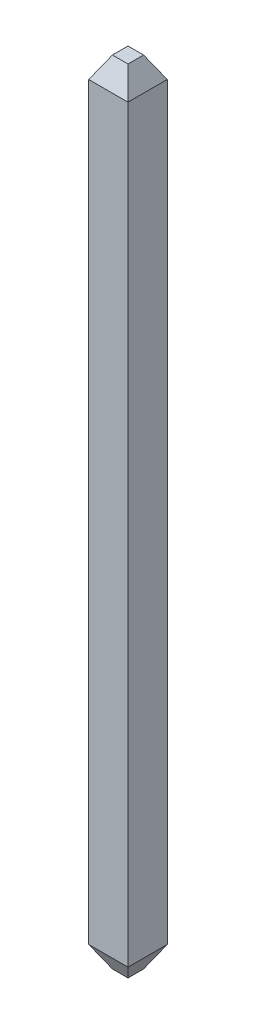
ISO-10303-21;
HEADER;
FILE_DESCRIPTION(('STEP AP214'),'2;1');
FILE_NAME('part.step','',(''),(''),'','','');
FILE_SCHEMA(('AUTOMOTIVE_DESIGN { 1 0 10303 214 1 1 1 1 }'));
ENDSEC;
DATA;
#1=APPLICATION_CONTEXT('core data for automotive mechanical design processes');
#2=APPLICATION_PROTOCOL_DEFINITION('international standard','automotive_design',2000,#1);
#3=PRODUCT_CONTEXT('',#1,'mechanical');
#4=PRODUCT('Part','Part','',(#3));
#5=PRODUCT_RELATED_PRODUCT_CATEGORY('part','',(#4));
#6=PRODUCT_DEFINITION_FORMATION('','',#4);
#7=PRODUCT_DEFINITION_CONTEXT('part definition',#1,'design');
#8=PRODUCT_DEFINITION('design','',#6,#7);
#9=PRODUCT_DEFINITION_SHAPE('','',#8);
#10=(LENGTH_UNIT() NAMED_UNIT(*) SI_UNIT(.MILLI.,.METRE.));
#11=(NAMED_UNIT(*) PLANE_ANGLE_UNIT() SI_UNIT($,.RADIAN.));
#12=(NAMED_UNIT(*) SI_UNIT($,.STERADIAN.) SOLID_ANGLE_UNIT());
#13=UNCERTAINTY_MEASURE_WITH_UNIT(LENGTH_MEASURE(1.E-05),#10,'distance_accuracy_value','');
#14=(GEOMETRIC_REPRESENTATION_CONTEXT(3) GLOBAL_UNCERTAINTY_ASSIGNED_CONTEXT((#13)) GLOBAL_UNIT_ASSIGNED_CONTEXT((#10,
#11,#12)) REPRESENTATION_CONTEXT('',''));
#15=CARTESIAN_POINT('',(0.,0.,0.));
#16=DIRECTION('',(0.,0.,1.));
#17=DIRECTION('',(1.,0.,0.));
#18=AXIS2_PLACEMENT_3D('',#15,#16,#17);
#19=CARTESIAN_POINT('',(0.497289871213,-21.22226807941,7.329039407632));
#20=DIRECTION('',(0.,0.488489958076213,0.87256951634738));
#21=DIRECTION('',(0.,-0.87256951634738,0.488489958076213));
#22=AXIS2_PLACEMENT_3D('',#19,#20,#21);
#23=PLANE('',#22);
#24=DIRECTION('',(1.,0.,0.));
#25=VECTOR('',#24,1.);
#26=CARTESIAN_POINT('',(0.497289871213,-21.57099360271,7.52426616385793));
#27=LINE('',#26,#25);
#28=CARTESIAN_POINT('',(0.48728989589798,-21.5709939289416,7.52426616384538));
#29=VERTEX_POINT('',#28);
#30=CARTESIAN_POINT('',(-0.142710289145667,-21.5709938896675,7.52426632450452));
#31=VERTEX_POINT('',#30);
#32=EDGE_CURVE('E118',#29,#31,#27,.F.);
#33=ORIENTED_EDGE('',*,*,#32,.F.);
#34=DIRECTION('',(0.438284036988266,-0.784297353956642,0.439072617567844));
#35=VECTOR('',#34,1.);
#36=CARTESIAN_POINT('',(0.29728987121219,-21.2309937745705,7.333924307213));
#37=LINE('',#36,#35);
#38=CARTESIAN_POINT('',(0.297289871212797,-21.2309937745703,7.33392430721258));
#39=VERTEX_POINT('',#38);
#40=EDGE_CURVE('E116',#39,#29,#37,.T.);
#41=ORIENTED_EDGE('',*,*,#40,.F.);
#42=DIRECTION('',(-1.,0.,0.));
#43=VECTOR('',#42,1.);
#44=CARTESIAN_POINT('',(0.307289871213,-21.23099377457,7.333924307213));
#45=LINE('',#44,#43);
#46=CARTESIAN_POINT('',(0.0472898712130297,-21.2309937745702,7.33392430721258));
#47=VERTEX_POINT('',#46);
#48=EDGE_CURVE('E79',#47,#39,#45,.F.);
#49=ORIENTED_EDGE('',*,*,#48,.F.);
#50=DIRECTION('',(0.438284036988272,0.784297353956654,-0.439072617567815));
#51=VECTOR('',#50,1.);
#52=CARTESIAN_POINT('',(-0.14271012878781,-21.5709936027095,7.524266163858));
#53=LINE('',#52,#51);
#54=EDGE_CURVE('E110',#31,#47,#53,.T.);
#55=ORIENTED_EDGE('',*,*,#54,.F.);
#56=EDGE_LOOP('',(#33,#41,#49,#55));
#57=FACE_BOUND('',#56,.T.);
#58=ADVANCED_FACE('F17',(#57),#23,.T.);
#59=CARTESIAN_POINT('',(0.497289871213,-33.93541112064,7.329291335356));
#60=DIRECTION('',(0.,-0.487152273933216,0.873317045523387));
#61=DIRECTION('',(0.,-0.873317045523387,-0.487152273933216));
#62=AXIS2_PLACEMENT_3D('',#59,#60,#61);
#63=PLANE('',#62);
#64=DIRECTION('',(-0.438586917260297,-0.784839349958942,-0.437799852403053));
#65=VECTOR('',#64,1.);
#66=CARTESIAN_POINT('',(0.487290184384019,-33.5866775616409,7.523822206765));
#67=LINE('',#66,#65);
#68=CARTESIAN_POINT('',(0.487289980136551,-33.5866774630266,7.52382196176172));
#69=VERTEX_POINT('',#68);
#70=CARTESIAN_POINT('',(0.29728987121302,-33.9266779501895,7.33416285809401));
#71=VERTEX_POINT('',#70);
#72=EDGE_CURVE('E122',#69,#71,#67,.T.);
#73=ORIENTED_EDGE('',*,*,#72,.F.);
#74=DIRECTION('',(1.,0.,0.));
#75=VECTOR('',#74,1.);
#76=CARTESIAN_POINT('',(0.497289871213,-33.5866774970136,7.52382284621967));
#77=LINE('',#76,#75);
#78=CARTESIAN_POINT('',(-0.142710305819022,-33.5866774872793,7.52382196001637));
#79=VERTEX_POINT('',#78);
#80=EDGE_CURVE('E89',#79,#69,#77,.T.);
#81=ORIENTED_EDGE('',*,*,#80,.F.);
#82=DIRECTION('',(-0.438586917260197,0.78483934995876,0.437799852403479));
#83=VECTOR('',#82,1.);
#84=CARTESIAN_POINT('',(0.0472898712136261,-33.9266779501897,7.334162858095));
#85=LINE('',#84,#83);
#86=CARTESIAN_POINT('',(0.0472898712132013,-33.9266779501894,7.33416285809401));
#87=VERTEX_POINT('',#86);
#88=EDGE_CURVE('E84',#87,#79,#85,.T.);
#89=ORIENTED_EDGE('',*,*,#88,.F.);
#90=DIRECTION('',(1.,0.,0.));
#91=VECTOR('',#90,1.);
#92=CARTESIAN_POINT('',(0.03728987121306,-33.92667795019,7.334162858095));
#93=LINE('',#92,#91);
#94=EDGE_CURVE('E20',#71,#87,#93,.F.);
#95=ORIENTED_EDGE('',*,*,#94,.F.);
#96=EDGE_LOOP('',(#73,#81,#89,#95));
#97=FACE_BOUND('',#96,.T.);
#98=ADVANCED_FACE('F86',(#97),#63,.T.);
#99=CARTESIAN_POINT('',(0.03728987121306,-33.92667795019,7.074162858095));
#100=DIRECTION('',(0.,-1.,0.));
#101=DIRECTION('',(1.,0.,0.));
#102=AXIS2_PLACEMENT_3D('',#99,#100,#101);
#103=PLANE('',#102);
#104=DIRECTION('',(0.,0.,1.));
#105=VECTOR('',#104,1.);
#106=CARTESIAN_POINT('',(0.0472898712136262,-33.9266779501897,6.883821001451));
#107=LINE('',#106,#105);
#108=CARTESIAN_POINT('',(0.0472898712133431,-33.9266779501896,7.08416285809541));
#109=VERTEX_POINT('',#108);
#110=EDGE_CURVE('E93',#109,#87,#107,.T.);
#111=ORIENTED_EDGE('',*,*,#110,.F.);
#112=DIRECTION('',(1.,0.,0.));
#113=VECTOR('',#112,1.);
#114=CARTESIAN_POINT('',(0.497289871213,-33.9266779501891,7.08416285809666));
#115=LINE('',#114,#113);
#116=CARTESIAN_POINT('',(0.29728987121304,-33.9266779501898,7.08416285809541));
#117=VERTEX_POINT('',#116);
#118=EDGE_CURVE('E129',#117,#109,#115,.F.);
#119=ORIENTED_EDGE('',*,*,#118,.F.);
#120=DIRECTION('',(0.,0.,1.));
#121=VECTOR('',#120,1.);
#122=CARTESIAN_POINT('',(0.297289871213079,-33.92667795019,6.883821001451));
#123=LINE('',#122,#121);
#124=EDGE_CURVE('E98',#71,#117,#123,.F.);
#125=ORIENTED_EDGE('',*,*,#124,.F.);
#126=ORIENTED_EDGE('',*,*,#94,.T.);
#127=EDGE_LOOP('',(#111,#119,#125,#126));
#128=FACE_BOUND('',#127,.T.);
#129=ADVANCED_FACE('F95',(#128),#103,.T.);
#130=CARTESIAN_POINT('',(0.05216808666874,-33.93540738396,6.883821001451));
#131=DIRECTION('',(-0.872943377132686,-0.487821545567825,0.));
#132=DIRECTION('',(0.487821545567825,-0.872943377132686,0.));
#133=AXIS2_PLACEMENT_3D('',#130,#131,#132);
#134=PLANE('',#133);
#135=DIRECTION('',(-0.43828470044216,0.784297071672232,-0.43907245953793));
#136=VECTOR('',#135,1.);
#137=CARTESIAN_POINT('',(0.04728987121306,-33.9266779501891,7.08416285809666));
#138=LINE('',#137,#136);
#139=CARTESIAN_POINT('',(-0.142710211258918,-33.5866782459584,6.89382181091626));
#140=VERTEX_POINT('',#139);
#141=EDGE_CURVE('E102',#109,#140,#138,.T.);
#142=ORIENTED_EDGE('',*,*,#141,.F.);
#143=ORIENTED_EDGE('',*,*,#110,.T.);
#144=ORIENTED_EDGE('',*,*,#88,.T.);
#145=DIRECTION('',(0.,0.,1.));
#146=VECTOR('',#145,1.);
#147=CARTESIAN_POINT('',(-0.142710128787,-33.58667874778,7.208990896586));
#148=LINE('',#147,#146);
#149=EDGE_CURVE('E131',#140,#79,#148,.T.);
#150=ORIENTED_EDGE('',*,*,#149,.F.);
#151=EDGE_LOOP('',(#142,#143,#144,#150));
#152=FACE_BOUND('',#151,.T.);
#153=ADVANCED_FACE('F100',(#152),#134,.T.);
#154=CARTESIAN_POINT('',(0.307289871213,-21.23099377457,7.073924307213));
#155=DIRECTION('',(0.,1.,0.));
#156=DIRECTION('',(-1.,0.,0.));
#157=AXIS2_PLACEMENT_3D('',#154,#155,#156);
#158=PLANE('',#157);
#159=ORIENTED_EDGE('',*,*,#48,.T.);
#160=DIRECTION('',(0.,0.,1.));
#161=VECTOR('',#160,1.);
#162=CARTESIAN_POINT('',(0.29728987121219,-21.2309937745705,6.884266163858));
#163=LINE('',#162,#161);
#164=CARTESIAN_POINT('',(0.297289871212797,-21.2309937745704,7.08392430721349));
#165=VERTEX_POINT('',#164);
#166=EDGE_CURVE('E113',#165,#39,#163,.T.);
#167=ORIENTED_EDGE('',*,*,#166,.F.);
#168=DIRECTION('',(1.,0.,0.));
#169=VECTOR('',#168,1.);
#170=CARTESIAN_POINT('',(0.497289871213,-21.2309937745711,7.08392430721497));
#171=LINE('',#170,#169);
#172=CARTESIAN_POINT('',(0.0472898712130296,-21.2309937745703,7.08392430721349));
#173=VERTEX_POINT('',#172);
#174=EDGE_CURVE('E140',#173,#165,#171,.T.);
#175=ORIENTED_EDGE('',*,*,#174,.F.);
#176=DIRECTION('',(0.,0.,1.));
#177=VECTOR('',#176,1.);
#178=CARTESIAN_POINT('',(0.0472898712129385,-21.2309937745699,6.884266163858));
#179=LINE('',#178,#177);
#180=EDGE_CURVE('E105',#47,#173,#179,.F.);
#181=ORIENTED_EDGE('',*,*,#180,.F.);
#182=EDGE_LOOP('',(#159,#167,#175,#181));
#183=FACE_BOUND('',#182,.T.);
#184=ADVANCED_FACE('F184',(#183),#158,.T.);
#185=CARTESIAN_POINT('',(-0.147588344243,-21.57972303648,6.884266163858));
#186=DIRECTION('',(-0.872943377132686,0.487821545567825,0.));
#187=DIRECTION('',(-0.487821545567825,-0.872943377132686,0.));
#188=AXIS2_PLACEMENT_3D('',#185,#186,#187);
#189=PLANE('',#188);
#190=DIRECTION('',(0.,0.,1.));
#191=VECTOR('',#190,1.);
#192=CARTESIAN_POINT('',(-0.142710128787008,-21.57099360271,7.208990896586));
#193=LINE('',#192,#191);
#194=CARTESIAN_POINT('',(-0.142710835596165,-21.5709953440113,6.89426575489926));
#195=VERTEX_POINT('',#194);
#196=EDGE_CURVE('E137',#31,#195,#193,.F.);
#197=ORIENTED_EDGE('',*,*,#196,.F.);
#198=ORIENTED_EDGE('',*,*,#54,.T.);
#199=ORIENTED_EDGE('',*,*,#180,.T.);
#200=DIRECTION('',(0.438586429090243,0.784840434712886,0.43779839681931));
#201=VECTOR('',#200,1.);
#202=CARTESIAN_POINT('',(-0.142710849418,-21.5709957406264,6.89426497129039));
#203=LINE('',#202,#201);
#204=EDGE_CURVE('E145',#195,#173,#203,.T.);
#205=ORIENTED_EDGE('',*,*,#204,.F.);
#206=EDGE_LOOP('',(#197,#198,#199,#205));
#207=FACE_BOUND('',#206,.T.);
#208=ADVANCED_FACE('F182',(#207),#189,.T.);
#209=CARTESIAN_POINT('',(0.292411655757,-21.2222643408,6.884266163858));
#210=DIRECTION('',(0.872943377132686,0.487821545567825,0.));
#211=DIRECTION('',(-0.487821545567825,0.872943377132686,0.));
#212=AXIS2_PLACEMENT_3D('',#209,#210,#211);
#213=PLANE('',#212);
#214=ORIENTED_EDGE('',*,*,#166,.T.);
#215=ORIENTED_EDGE('',*,*,#40,.T.);
#216=DIRECTION('',(0.,0.,1.));
#217=VECTOR('',#216,1.);
#218=CARTESIAN_POINT('',(0.487289871212996,-21.57099621256,6.883872654069));
#219=LINE('',#218,#217);
#220=CARTESIAN_POINT('',(0.487290141449586,-21.5709947896532,6.89426628939786));
#221=VERTEX_POINT('',#220);
#222=EDGE_CURVE('E35',#221,#29,#219,.T.);
#223=ORIENTED_EDGE('',*,*,#222,.F.);
#224=DIRECTION('',(0.438586429090131,-0.784840434712933,-0.437798396819336));
#225=VECTOR('',#224,1.);
#226=CARTESIAN_POINT('',(0.297289871213,-21.2309937745711,7.08392430721497));
#227=LINE('',#226,#225);
#228=EDGE_CURVE('E143',#165,#221,#227,.T.);
#229=ORIENTED_EDGE('',*,*,#228,.F.);
#230=EDGE_LOOP('',(#214,#215,#223,#229));
#231=FACE_BOUND('',#230,.T.);
#232=ADVANCED_FACE('F185',(#231),#213,.T.);
#233=CARTESIAN_POINT('',(0.497289871213,-21.45033675752,7.524270615482));
#234=DIRECTION('',(0.,-3.68949151673641E-05,0.999999999319383));
#235=DIRECTION('',(0.,-0.999999999319383,-3.68949151673641E-05));
#236=AXIS2_PLACEMENT_3D('',#233,#234,#235);
#237=PLANE('',#236);
#238=DIRECTION('',(0.,0.999999999317418,3.6948133506474E-05));
#239=VECTOR('',#238,1.);
#240=CARTESIAN_POINT('',(-0.142710128787,-33.58667749699,7.523822206765));
#241=LINE('',#240,#239);
#242=EDGE_CURVE('E134',#79,#31,#241,.T.);
#243=ORIENTED_EDGE('',*,*,#242,.F.);
#244=ORIENTED_EDGE('',*,*,#80,.T.);
#245=DIRECTION('',(0.,-0.999999999317418,-3.6948133506474E-05));
#246=VECTOR('',#245,1.);
#247=CARTESIAN_POINT('',(0.487289871212996,-21.57099360271,7.524266163858));
#248=LINE('',#247,#246);
#249=EDGE_CURVE('E149',#29,#69,#248,.T.);
#250=ORIENTED_EDGE('',*,*,#249,.F.);
#251=ORIENTED_EDGE('',*,*,#32,.T.);
#252=EDGE_LOOP('',(#243,#244,#250,#251));
#253=FACE_BOUND('',#252,.T.);
#254=ADVANCED_FACE('F187',(#253),#237,.T.);
#255=CARTESIAN_POINT('',(0.492168086669,-33.57794868828,6.883821001451));
#256=DIRECTION('',(0.872943377132686,-0.487821545567825,0.));
#257=DIRECTION('',(0.487821545567825,0.872943377132686,0.));
#258=AXIS2_PLACEMENT_3D('',#255,#256,#257);
#259=PLANE('',#258);
#260=ORIENTED_EDGE('',*,*,#124,.T.);
#261=DIRECTION('',(-0.438284700442048,-0.78429707167228,0.439072459537957));
#262=VECTOR('',#261,1.);
#263=CARTESIAN_POINT('',(0.487289673578,-33.5866791127601,6.89382155607999));
#264=LINE('',#263,#262);
#265=CARTESIAN_POINT('',(0.487289755137329,-33.5866786503075,6.89382212481551));
#266=VERTEX_POINT('',#265);
#267=EDGE_CURVE('E126',#266,#117,#264,.T.);
#268=ORIENTED_EDGE('',*,*,#267,.F.);
#269=DIRECTION('',(0.,0.,1.));
#270=VECTOR('',#269,1.);
#271=CARTESIAN_POINT('',(0.487289871213004,-33.58667749699,6.883872654069));
#272=LINE('',#271,#270);
#273=EDGE_CURVE('E152',#69,#266,#272,.F.);
#274=ORIENTED_EDGE('',*,*,#273,.F.);
#275=ORIENTED_EDGE('',*,*,#72,.T.);
#276=EDGE_LOOP('',(#260,#268,#274,#275));
#277=FACE_BOUND('',#276,.T.);
#278=ADVANCED_FACE('F174',(#277),#259,.T.);
#279=CARTESIAN_POINT('',(0.497289871213,-33.93540364535,7.089047757676));
#280=DIRECTION('',(0.,-0.488489958076213,-0.87256951634738));
#281=DIRECTION('',(0.,0.87256951634738,-0.488489958076213));
#282=AXIS2_PLACEMENT_3D('',#279,#280,#281);
#283=PLANE('',#282);
#284=ORIENTED_EDGE('',*,*,#267,.T.);
#285=ORIENTED_EDGE('',*,*,#118,.T.);
#286=ORIENTED_EDGE('',*,*,#141,.T.);
#287=DIRECTION('',(1.,0.,0.));
#288=VECTOR('',#287,1.);
#289=CARTESIAN_POINT('',(0.497289871213,-33.5866787478035,6.89382284617289));
#290=LINE('',#289,#288);
#291=EDGE_CURVE('E155',#266,#140,#290,.F.);
#292=ORIENTED_EDGE('',*,*,#291,.F.);
#293=EDGE_LOOP('',(#284,#285,#286,#292));
#294=FACE_BOUND('',#293,.T.);
#295=ADVANCED_FACE('F177',(#294),#283,.T.);
#296=CARTESIAN_POINT('',(-0.142710128787,-33.75733847732,7.208990896586));
#297=DIRECTION('',(-1.,0.,0.));
#298=DIRECTION('',(0.,-1.,0.));
#299=AXIS2_PLACEMENT_3D('',#296,#297,#298);
#300=PLANE('',#299);
#301=ORIENTED_EDGE('',*,*,#196,.T.);
#302=DIRECTION('',(0.,0.999999999319383,3.68949151675341E-05));
#303=VECTOR('',#302,1.);
#304=CARTESIAN_POINT('',(-0.142709931152,-33.75734199129,6.893816549567));
#305=LINE('',#304,#303);
#306=EDGE_CURVE('E158',#140,#195,#305,.T.);
#307=ORIENTED_EDGE('',*,*,#306,.F.);
#308=ORIENTED_EDGE('',*,*,#149,.T.);
#309=ORIENTED_EDGE('',*,*,#242,.T.);
#310=EDGE_LOOP('',(#301,#307,#308,#309));
#311=FACE_BOUND('',#310,.T.);
#312=ADVANCED_FACE('F179',(#311),#300,.T.);
#313=CARTESIAN_POINT('',(0.497289871213,-21.22226060412,7.088795829952));
#314=DIRECTION('',(0.,0.487152273933216,-0.873317045523387));
#315=DIRECTION('',(0.,0.873317045523387,0.487152273933216));
#316=AXIS2_PLACEMENT_3D('',#313,#314,#315);
#317=PLANE('',#316);
#318=DIRECTION('',(1.,0.,0.));
#319=VECTOR('',#318,1.);
#320=CARTESIAN_POINT('',(0.497289871213,-21.5709962125728,6.89426616376101));
#321=LINE('',#320,#319);
#322=EDGE_CURVE('E26',#195,#221,#321,.T.);
#323=ORIENTED_EDGE('',*,*,#322,.F.);
#324=ORIENTED_EDGE('',*,*,#204,.T.);
#325=ORIENTED_EDGE('',*,*,#174,.T.);
#326=ORIENTED_EDGE('',*,*,#228,.T.);
#327=EDGE_LOOP('',(#323,#324,#325,#326));
#328=FACE_BOUND('',#327,.T.);
#329=ADVANCED_FACE('F168',(#328),#317,.T.);
#330=CARTESIAN_POINT('',(0.487289871213,-27.60384299983,6.883872654069));
#331=DIRECTION('',(1.,0.,0.));
#332=DIRECTION('',(0.,1.,0.));
#333=AXIS2_PLACEMENT_3D('',#330,#331,#332);
#334=PLANE('',#333);
#335=ORIENTED_EDGE('',*,*,#249,.T.);
#336=ORIENTED_EDGE('',*,*,#273,.T.);
#337=DIRECTION('',(0.,0.999999999319383,3.68949151675341E-05));
#338=VECTOR('',#337,1.);
#339=CARTESIAN_POINT('',(0.487290591844,-33.75734199129,6.893816549567));
#340=LINE('',#339,#338);
#341=EDGE_CURVE('E11',#221,#266,#340,.F.);
#342=ORIENTED_EDGE('',*,*,#341,.F.);
#343=ORIENTED_EDGE('',*,*,#222,.T.);
#344=EDGE_LOOP('',(#335,#336,#342,#343));
#345=FACE_BOUND('',#344,.T.);
#346=ADVANCED_FACE('F170',(#345),#334,.T.);
#347=CARTESIAN_POINT('',(0.497289871213,-33.75734199129,6.893816549567));
#348=DIRECTION('',(0.,3.68949151675341E-05,-0.999999999319383));
#349=DIRECTION('',(0.,0.999999999319383,3.68949151675341E-05));
#350=AXIS2_PLACEMENT_3D('',#347,#348,#349);
#351=PLANE('',#350);
#352=ORIENTED_EDGE('',*,*,#322,.T.);
#353=ORIENTED_EDGE('',*,*,#341,.T.);
#354=ORIENTED_EDGE('',*,*,#291,.T.);
#355=ORIENTED_EDGE('',*,*,#306,.T.);
#356=EDGE_LOOP('',(#352,#353,#354,#355));
#357=FACE_BOUND('',#356,.T.);
#358=ADVANCED_FACE('F164',(#357),#351,.T.);
#359=CLOSED_SHELL('',(#58,#98,#129,#153,#184,#208,#232,#254,#278,#295,#312,#329,#346,#358));
#360=MANIFOLD_SOLID_BREP('B1',#359);
#361=ADVANCED_BREP_SHAPE_REPRESENTATION('',(#18,#360),#14);
#362=SHAPE_DEFINITION_REPRESENTATION(#9,#361);
ENDSEC;
END-ISO-10303-21;
